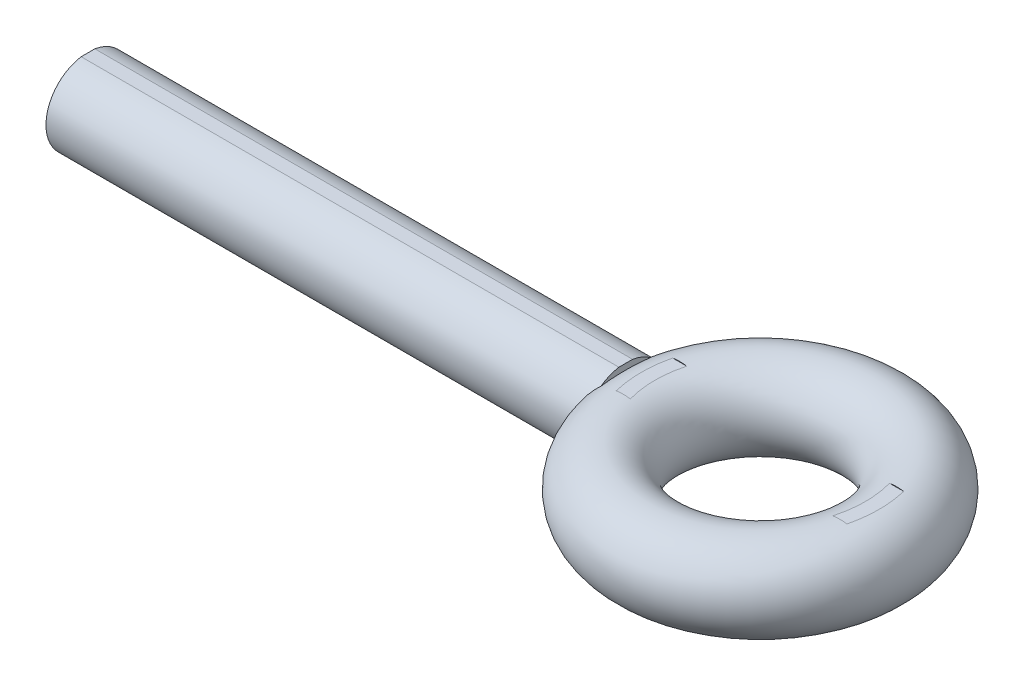
ISO-10303-21;
HEADER;
FILE_DESCRIPTION(('STEP AP214'),'2;1');
FILE_NAME('part.step','',(''),(''),'','','');
FILE_SCHEMA(('AUTOMOTIVE_DESIGN { 1 0 10303 214 1 1 1 1 }'));
ENDSEC;
DATA;
#1=APPLICATION_CONTEXT('core data for automotive mechanical design processes');
#2=APPLICATION_PROTOCOL_DEFINITION('international standard','automotive_design',2000,#1);
#3=PRODUCT_CONTEXT('',#1,'mechanical');
#4=PRODUCT('Part','Part','',(#3));
#5=PRODUCT_RELATED_PRODUCT_CATEGORY('part','',(#4));
#6=PRODUCT_DEFINITION_FORMATION('','',#4);
#7=PRODUCT_DEFINITION_CONTEXT('part definition',#1,'design');
#8=PRODUCT_DEFINITION('design','',#6,#7);
#9=PRODUCT_DEFINITION_SHAPE('','',#8);
#10=(LENGTH_UNIT() NAMED_UNIT(*) SI_UNIT(.MILLI.,.METRE.));
#11=(NAMED_UNIT(*) PLANE_ANGLE_UNIT() SI_UNIT($,.RADIAN.));
#12=(NAMED_UNIT(*) SI_UNIT($,.STERADIAN.) SOLID_ANGLE_UNIT());
#13=UNCERTAINTY_MEASURE_WITH_UNIT(LENGTH_MEASURE(1.E-05),#10,'distance_accuracy_value','');
#14=(GEOMETRIC_REPRESENTATION_CONTEXT(3) GLOBAL_UNCERTAINTY_ASSIGNED_CONTEXT((#13)) GLOBAL_UNIT_ASSIGNED_CONTEXT((#10,
#11,#12)) REPRESENTATION_CONTEXT('',''));
#15=CARTESIAN_POINT('',(0.,0.,0.));
#16=DIRECTION('',(0.,0.,1.));
#17=DIRECTION('',(1.,0.,0.));
#18=AXIS2_PLACEMENT_3D('',#15,#16,#17);
#19=CARTESIAN_POINT('',(93.6625,4.699,-3.17814504581193));
#20=DIRECTION('',(0.,1.,0.));
#21=DIRECTION('',(0.,0.,1.));
#22=AXIS2_PLACEMENT_3D('',#19,#20,#21);
#23=PLANE('',#22);
#24=DIRECTION('',(-1.,0.,0.));
#25=VECTOR('',#24,1.);
#26=CARTESIAN_POINT('',(60.96,4.699,-0.775116281599091));
#27=LINE('',#26,#25);
#28=CARTESIAN_POINT('',(0.,4.699,-0.775116281599091));
#29=VERTEX_POINT('',#28);
#30=CARTESIAN_POINT('',(60.96,4.699,-0.775116281599091));
#31=VERTEX_POINT('',#30);
#32=EDGE_CURVE('E119',#29,#31,#27,.F.);
#33=ORIENTED_EDGE('',*,*,#32,.F.);
#34=DIRECTION('',(0.,0.,-1.));
#35=VECTOR('',#34,1.);
#36=CARTESIAN_POINT('',(0.,4.699,-0.775116281599091));
#37=LINE('',#36,#35);
#38=CARTESIAN_POINT('',(0.,4.699,0.775116281599092));
#39=VERTEX_POINT('',#38);
#40=EDGE_CURVE('E120',#39,#29,#37,.T.);
#41=ORIENTED_EDGE('',*,*,#40,.F.);
#42=DIRECTION('',(-1.,0.,0.));
#43=VECTOR('',#42,1.);
#44=CARTESIAN_POINT('',(60.96,4.699,0.775116281599092));
#45=LINE('',#44,#43);
#46=CARTESIAN_POINT('',(60.96,4.699,0.775116281599092));
#47=VERTEX_POINT('',#46);
#48=EDGE_CURVE('E175',#47,#39,#45,.T.);
#49=ORIENTED_EDGE('',*,*,#48,.F.);
#50=DIRECTION('',(0.,0.,-1.));
#51=VECTOR('',#50,1.);
#52=CARTESIAN_POINT('',(60.96,4.699,0.));
#53=LINE('',#52,#51);
#54=EDGE_CURVE('E176',#31,#47,#53,.F.);
#55=ORIENTED_EDGE('',*,*,#54,.F.);
#56=EDGE_LOOP('',(#33,#41,#49,#55));
#57=FACE_BOUND('',#56,.T.);
#58=ADVANCED_FACE('F40',(#57),#23,.T.);
#59=CARTESIAN_POINT('',(60.96,0.,0.));
#60=DIRECTION('',(1.,0.,0.));
#61=DIRECTION('',(0.,0.,-1.));
#62=AXIS2_PLACEMENT_3D('',#59,#60,#61);
#63=PLANE('',#62);
#64=CARTESIAN_POINT('',(60.96,-3.85680829831834,2.79400000002241));
#65=CARTESIAN_POINT('',(60.96,-3.88106554887793,2.60811533049679));
#66=CARTESIAN_POINT('',(60.96,-3.90241108362914,2.42186657422565));
#67=CARTESIAN_POINT('',(60.96,-3.93969565290047,2.04931800768592));
#68=CARTESIAN_POINT('',(60.96,-3.95564867072227,1.86301960284457));
#69=CARTESIAN_POINT('',(60.96,-3.98266267944582,1.49041115000553));
#70=CARTESIAN_POINT('',(60.96,-3.99373242918019,1.30410172726012));
#71=CARTESIAN_POINT('',(60.96,-4.01130742422769,0.931486209871611));
#72=CARTESIAN_POINT('',(60.96,-4.01781796126506,0.745180363181703));
#73=CARTESIAN_POINT('',(60.96,-4.02647459383097,0.372582969947983));
#74=CARTESIAN_POINT('',(60.96,-4.02862336909261,0.186291484979667));
#75=CARTESIAN_POINT('',(60.96,-4.02862336909279,-0.186291484956967));
#76=CARTESIAN_POINT('',(60.96,-4.02647459383132,-0.372582969925284));
#77=CARTESIAN_POINT('',(60.96,-4.01781796126576,-0.745180363159011));
#78=CARTESIAN_POINT('',(60.96,-4.01130742422858,-0.931486209848925));
#79=CARTESIAN_POINT('',(60.96,-3.99373242918144,-1.30410172723745));
#80=CARTESIAN_POINT('',(60.96,-3.98266267944726,-1.49041114998287));
#81=CARTESIAN_POINT('',(60.96,-3.95564867072411,-1.86301960282194));
#82=CARTESIAN_POINT('',(60.96,-3.93969565290251,-2.04931800766331));
#83=CARTESIAN_POINT('',(60.96,-3.90241108363162,-2.42186657420308));
#84=CARTESIAN_POINT('',(60.96,-3.88106554888064,-2.60811533047424));
#85=CARTESIAN_POINT('',(60.96,-3.85680829832128,-2.79399999999989));
#86=B_SPLINE_CURVE_WITH_KNOTS('',3,(#64,#65,#66,#67,#68,#69,#70,#71,#72,#73,#74,#75,#76,#77,#78,
#79,#80,#81,#82,#83,#84,#85),.UNSPECIFIED.,.F.,.F.,(4,2,2,2,2,2,2,2,2,2,4),(0.,
0.562336181640379,1.12320278141193,1.68305925610424,2.24226484243817,2.8011267658447,
3.35998868925122,3.91919427558516,4.47905075027746,5.03991735004901,5.60225353168939),.UNSPECIFIED.);
#87=CARTESIAN_POINT('',(60.96,-3.85680829831228,2.79400000002161));
#88=VERTEX_POINT('',#87);
#89=CARTESIAN_POINT('',(60.96,-3.85680829832135,-2.79399999999992));
#90=VERTEX_POINT('',#89);
#91=EDGE_CURVE('E109',#88,#90,#86,.T.);
#92=ORIENTED_EDGE('',*,*,#91,.F.);
#93=CARTESIAN_POINT('',(60.96,0.,0.));
#94=DIRECTION('',(-1.,0.,0.));
#95=DIRECTION('',(0.,0.,1.));
#96=AXIS2_PLACEMENT_3D('',#93,#94,#95);
#97=CIRCLE('',#96,4.7625);
#98=EDGE_CURVE('E43',#90,#88,#97,.T.);
#99=ORIENTED_EDGE('',*,*,#98,.F.);
#100=EDGE_LOOP('',(#92,#99));
#101=FACE_BOUND('',#100,.T.);
#102=ADVANCED_FACE('F121',(#101),#63,.T.);
#103=CARTESIAN_POINT('',(60.96,0.,0.));
#104=DIRECTION('',(1.,0.,0.));
#105=DIRECTION('',(0.,0.,-1.));
#106=AXIS2_PLACEMENT_3D('',#103,#104,#105);
#107=PLANE('',#106);
#108=CARTESIAN_POINT('',(60.96,0.,0.));
#109=DIRECTION('',(-1.,0.,0.));
#110=DIRECTION('',(0.,0.,1.));
#111=AXIS2_PLACEMENT_3D('',#108,#109,#110);
#112=CIRCLE('',#111,4.7625);
#113=CARTESIAN_POINT('',(60.9599999999962,3.85680829831314,2.79400000001125));
#114=VERTEX_POINT('',#113);
#115=EDGE_CURVE('E141',#114,#47,#112,.T.);
#116=ORIENTED_EDGE('',*,*,#115,.F.);
#117=CARTESIAN_POINT('',(60.96,3.85680829831818,-2.79400000002366));
#118=CARTESIAN_POINT('',(60.96,3.88106554887787,-2.60811533049741));
#119=CARTESIAN_POINT('',(60.96,3.90241108362915,-2.42186657422565));
#120=CARTESIAN_POINT('',(60.96,3.93969565290058,-2.04931800768467));
#121=CARTESIAN_POINT('',(60.96,3.95564867072242,-1.8630196028427));
#122=CARTESIAN_POINT('',(60.96,3.98266267944602,-1.49041115000241));
#123=CARTESIAN_POINT('',(60.96,3.9937324291804,-1.30410172725638));
#124=CARTESIAN_POINT('',(60.96,4.01130742422789,-0.931486209866634));
#125=CARTESIAN_POINT('',(60.96,4.01781796126524,-0.745180363176106));
#126=CARTESIAN_POINT('',(60.96,4.02647459383108,-0.37258296994115));
#127=CARTESIAN_POINT('',(60.96,4.02862336909267,-0.186291484972216));
#128=CARTESIAN_POINT('',(60.96,4.02862336909272,0.186291484965653));
#129=CARTESIAN_POINT('',(60.96,4.02647459383118,0.372582969934587));
#130=CARTESIAN_POINT('',(60.96,4.01781796126544,0.745180363169546));
#131=CARTESIAN_POINT('',(60.96,4.01130742422815,0.931486209860076));
#132=CARTESIAN_POINT('',(60.96,3.99373242918076,1.30410172724983));
#133=CARTESIAN_POINT('',(60.96,3.98266267944644,1.49041114999586));
#134=CARTESIAN_POINT('',(60.96,3.95564867072295,1.86301960283616));
#135=CARTESIAN_POINT('',(60.96,3.93969565290118,2.04931800767813));
#136=CARTESIAN_POINT('',(60.96,3.90241108362987,2.42186657421913));
#137=CARTESIAN_POINT('',(60.96,3.88106554887865,2.60811533049089));
#138=CARTESIAN_POINT('',(60.96,3.85680829831903,2.79400000001715));
#139=B_SPLINE_CURVE_WITH_KNOTS('',3,(#117,#118,#119,#120,#121,#122,#123,#124,#125,#126,#127,
#128,#129,#130,#131,#132,#133,#134,#135,#136,#137,#138),.UNSPECIFIED.,.F.,.F.,(4,2,2,2,2,2,2,2,
2,2,4),(0.,0.562336181642267,1.12320278141569,1.68305925610986,2.24226484244565,
2.80112676585402,3.3599886892624,3.91919427559819,4.47905075029236,5.03991735006578,
5.60225353170805),.UNSPECIFIED.);
#140=CARTESIAN_POINT('',(60.96,3.85680829831177,-2.79400000002282));
#141=VERTEX_POINT('',#140);
#142=EDGE_CURVE('E111',#141,#114,#139,.T.);
#143=ORIENTED_EDGE('',*,*,#142,.F.);
#144=CARTESIAN_POINT('',(60.96,0.,0.));
#145=DIRECTION('',(-1.,0.,0.));
#146=DIRECTION('',(0.,0.,1.));
#147=AXIS2_PLACEMENT_3D('',#144,#145,#146);
#148=CIRCLE('',#147,4.7625);
#149=EDGE_CURVE('E178',#141,#31,#148,.F.);
#150=ORIENTED_EDGE('',*,*,#149,.T.);
#151=ORIENTED_EDGE('',*,*,#54,.T.);
#152=EDGE_LOOP('',(#116,#143,#150,#151));
#153=FACE_BOUND('',#152,.T.);
#154=ADVANCED_FACE('F253',(#153),#107,.T.);
#155=CARTESIAN_POINT('',(60.96,0.,0.));
#156=DIRECTION('',(-1.,0.,0.));
#157=DIRECTION('',(0.,0.,1.));
#158=AXIS2_PLACEMENT_3D('',#155,#156,#157);
#159=CYLINDRICAL_SURFACE('',#158,4.7625);
#160=ORIENTED_EDGE('',*,*,#149,.F.);
#161=CARTESIAN_POINT('',(60.9600000000001,-3.85680829832134,-2.79399999999994));
#162=CARTESIAN_POINT('',(60.8785504523994,-3.7860101988597,-2.89173469472768));
#163=CARTESIAN_POINT('',(60.7990695374057,-3.71067503111005,-2.98790012670303));
#164=CARTESIAN_POINT('',(60.6445111305986,-3.55077235846282,-3.17627109256745));
#165=CARTESIAN_POINT('',(60.5694391562109,-3.46619364920776,-3.26847162765873));
#166=CARTESIAN_POINT('',(60.4239376012221,-3.28729069450069,-3.44837843563018));
#167=CARTESIAN_POINT('',(60.3535381517923,-3.19291169246871,-3.53605485381351));
#168=CARTESIAN_POINT('',(60.2185487215298,-2.99496076167127,-3.70520605164519));
#169=CARTESIAN_POINT('',(60.153955862238,-2.89139343892524,-3.78668390095148));
#170=CARTESIAN_POINT('',(60.0410643418266,-2.69259866790364,-3.9298638988467));
#171=CARTESIAN_POINT('',(59.9918121401095,-2.59868790190733,-3.99264439293863));
#172=CARTESIAN_POINT('',(59.8983082570006,-2.40482600948102,-4.11232158725517));
#173=CARTESIAN_POINT('',(59.8540557747586,-2.30487585438243,-4.16921922966512));
#174=CARTESIAN_POINT('',(59.7710684374688,-2.09953043245678,-4.27630208728406));
#175=CARTESIAN_POINT('',(59.7323226595295,-1.99414652642704,-4.32650057825406));
#176=CARTESIAN_POINT('',(59.6606774378077,-1.77829350779267,-4.41960262201934));
#177=CARTESIAN_POINT('',(59.6277771240797,-1.66782515496204,-4.46250726027399));
#178=CARTESIAN_POINT('',(59.5713911744848,-1.45447182014165,-4.53621745699394));
#179=CARTESIAN_POINT('',(59.5472764646304,-1.35202935920477,-4.56782440875256));
#180=CARTESIAN_POINT('',(59.5042945939236,-1.14422234932699,-4.62425655307724));
#181=CARTESIAN_POINT('',(59.485426709522,-1.03885820549886,-4.64908268072604));
#182=CARTESIAN_POINT('',(59.4531800081042,-0.826067705733072,-4.69156378379552));
#183=CARTESIAN_POINT('',(59.4397915106254,-0.718645340753197,-4.70923140563128));
#184=CARTESIAN_POINT('',(59.4186217060468,-0.502341322280044,-4.73718678222424));
#185=CARTESIAN_POINT('',(59.4108371622417,-0.393460548206505,-4.74747879693439));
#186=CARTESIAN_POINT('',(59.4037602022141,-0.236966014565057,-4.75683732497496));
#187=CARTESIAN_POINT('',(59.4021553757281,-0.18961427871017,-4.75895995347434));
#188=CARTESIAN_POINT('',(59.4000147126558,-0.0948438224345969,-4.76179151837386));
#189=CARTESIAN_POINT('',(59.3994788949018,-0.0474251008485867,-4.76250042986934));
#190=CARTESIAN_POINT('',(59.399479843835,0.113393800140544,-4.76249897217895));
#191=CARTESIAN_POINT('',(59.4025453398251,0.226824070065428,-4.75844269672319));
#192=CARTESIAN_POINT('',(59.4147713822717,0.452829871615858,-4.74227809349639));
#193=CARTESIAN_POINT('',(59.4239358211327,0.565404810925087,-4.73016462354828));
#194=CARTESIAN_POINT('',(59.4482662213249,0.789002410434107,-4.69804868121557));
#195=CARTESIAN_POINT('',(59.4634442500447,0.900021481833622,-4.67803034651804));
#196=CARTESIAN_POINT('',(59.4996143750039,1.1194985374963,-4.63041549029862));
#197=CARTESIAN_POINT('',(59.5206089519626,1.22795540753036,-4.60281573539386));
#198=CARTESIAN_POINT('',(59.5680351625792,1.44098556791716,-4.54061794381888));
#199=CARTESIAN_POINT('',(59.5944380753438,1.54557606193287,-4.50605689057745));
#200=CARTESIAN_POINT('',(59.652452220066,1.75086653181407,-4.43033450871213));
#201=CARTESIAN_POINT('',(59.6840654798536,1.85156497400867,-4.38917061047536));
#202=CARTESIAN_POINT('',(59.7862012831295,2.14686471254733,-4.25662019578979));
#203=CARTESIAN_POINT('',(59.864081828659,2.33494464971961,-4.15609312810247));
#204=CARTESIAN_POINT('',(60.0420311652813,2.70158686258682,-3.92840815784323));
#205=CARTESIAN_POINT('',(60.1431857512938,2.87881094953318,-3.79997484165973));
#206=CARTESIAN_POINT('',(60.3613693660764,3.20853260520096,-3.52599768340604));
#207=CARTESIAN_POINT('',(60.4784026145598,3.36102357743167,-3.38044929442504));
#208=CARTESIAN_POINT('',(60.6590215499961,3.5656304910323,-3.15861142149541));
#209=CARTESIAN_POINT('',(60.7175533205018,3.62766845363822,-3.08710937714316));
#210=CARTESIAN_POINT('',(60.8370059042828,3.7462640988818,-2.94204842975802));
#211=CARTESIAN_POINT('',(60.8979198358935,3.80283613467735,-2.86849560560491));
#212=CARTESIAN_POINT('',(60.9599999999874,3.85680829831034,-2.79400000001512));
#213=B_SPLINE_CURVE_WITH_KNOTS('',3,(#161,#162,#163,#164,#165,#166,#167,#168,#169,#170,#171,
#172,#173,#174,#175,#176,#177,#178,#179,#180,#181,#182,#183,#184,#185,#186,#187,#188,#189,#190,
#191,#192,#193,#194,#195,#196,#197,#198,#199,#200,#201,#202,#203,#204,#205,#206,#207,#208,#209,
#210,#211,#212),.UNSPECIFIED.,.F.,.F.,(4,2,2,2,2,2,2,2,2,2,2,2,2,2,2,2,2,2,2,2,2,2,2,2,2,4),(0.,
0.436776236091201,0.874087899341334,1.31398980725578,1.75367242918317,2.12301046354662,
2.49228925356734,2.86082501551345,3.22930588446079,3.55860854371662,3.88786576883759,
4.21653875587007,4.54502175686349,4.68727364610974,4.82952804130651,5.16965945197457,
5.51000814625,5.85104330109867,6.19222412969371,6.53163802747237,6.87118433602823,
7.54940865378636,8.27019930732146,8.99118188565513,9.32493200027034,9.65778042791278),.UNSPECIFIED.);
#214=EDGE_CURVE('E99',#90,#141,#213,.T.);
#215=ORIENTED_EDGE('',*,*,#214,.F.);
#216=ORIENTED_EDGE('',*,*,#98,.T.);
#217=CARTESIAN_POINT('',(60.9599999999924,3.85680829831465,2.79400000000916));
#218=CARTESIAN_POINT('',(60.8785504523919,3.78601019885286,2.89173469473663));
#219=CARTESIAN_POINT('',(60.7990695373985,3.71067503110306,2.9879001267117));
#220=CARTESIAN_POINT('',(60.644511130592,3.55077235845558,3.17627109257554));
#221=CARTESIAN_POINT('',(60.5694391562045,3.4661936492004,3.26847162766653));
#222=CARTESIAN_POINT('',(60.4239376012163,3.28729069449315,3.44837843563737));
#223=CARTESIAN_POINT('',(60.3535381517868,3.19291169246109,3.53605485382039));
#224=CARTESIAN_POINT('',(60.2185487215248,2.99496076166354,3.70520605165144));
#225=CARTESIAN_POINT('',(60.1539558622333,2.89139343891745,3.7866839009574));
#226=CARTESIAN_POINT('',(60.0410643418224,2.69259866789574,3.92986389885209));
#227=CARTESIAN_POINT('',(59.9918121401054,2.59868790189936,3.99264439294381));
#228=CARTESIAN_POINT('',(59.8983082569969,2.40482600947291,4.11232158725991));
#229=CARTESIAN_POINT('',(59.8540557747551,2.30487585437427,4.16921922966964));
#230=CARTESIAN_POINT('',(59.7710684374657,2.09953043244852,4.27630208728811));
#231=CARTESIAN_POINT('',(59.7323226595265,1.99414652641874,4.32650057825788));
#232=CARTESIAN_POINT('',(59.6606774378051,1.77829350778432,4.4196026220227));
#233=CARTESIAN_POINT('',(59.6277771240773,1.66782515495368,4.46250726027712));
#234=CARTESIAN_POINT('',(59.5713911744827,1.45447182013319,4.53621745699665));
#235=CARTESIAN_POINT('',(59.5472764646285,1.35202935919623,4.56782440875508));
#236=CARTESIAN_POINT('',(59.504294593922,1.14422234931831,4.62425655307939));
#237=CARTESIAN_POINT('',(59.4854267095205,1.03885820549012,4.649082680728));
#238=CARTESIAN_POINT('',(59.4531800081031,0.826067705724223,4.69156378379708));
#239=CARTESIAN_POINT('',(59.4397915106244,0.718645340744307,4.70923140563263));
#240=CARTESIAN_POINT('',(59.4186217060461,0.502341322271099,4.73718678222519));
#241=CARTESIAN_POINT('',(59.4108371622412,0.393460548197545,4.74747879693516));
#242=CARTESIAN_POINT('',(59.4037602022139,0.236966014559423,4.75683732497522));
#243=CARTESIAN_POINT('',(59.402155375728,0.189614278707876,4.7589599534744));
#244=CARTESIAN_POINT('',(59.4000147126559,0.0948438224389941,4.76179151837373));
#245=CARTESIAN_POINT('',(59.3994788949019,0.0474251008563339,4.76250042986922));
#246=CARTESIAN_POINT('',(59.3994798438348,-0.11339380012936,4.76249897217921));
#247=CARTESIAN_POINT('',(59.4025453398247,-0.226824070054171,4.75844269672372));
#248=CARTESIAN_POINT('',(59.4147713822709,-0.452829871604488,4.74227809349748));
#249=CARTESIAN_POINT('',(59.4239358211316,-0.565404810913676,4.73016462354965));
#250=CARTESIAN_POINT('',(59.4482662213234,-0.789002410422648,4.69804868121749));
#251=CARTESIAN_POINT('',(59.4634442500431,-0.900021481822155,4.67803034652024));
#252=CARTESIAN_POINT('',(59.4996143750018,-1.11949853748485,4.63041549030139));
#253=CARTESIAN_POINT('',(59.5206089519603,-1.22795540751894,4.60281573539691));
#254=CARTESIAN_POINT('',(59.5680351625765,-1.44098556790582,4.54061794382249));
#255=CARTESIAN_POINT('',(59.5944380753409,-1.54557606192158,4.50605689058132));
#256=CARTESIAN_POINT('',(59.6524522200626,-1.75086653180292,4.43033450871653));
#257=CARTESIAN_POINT('',(59.68406547985,-1.8515649739976,4.38917061048002));
#258=CARTESIAN_POINT('',(59.7862012831253,-2.14686471253654,4.25662019579524));
#259=CARTESIAN_POINT('',(59.8640818286543,-2.33494464970905,4.15609312810842));
#260=CARTESIAN_POINT('',(60.0420311652758,-2.7015868625767,3.9284081578502));
#261=CARTESIAN_POINT('',(60.1431857512878,-2.87881094952327,3.79997484166724));
#262=CARTESIAN_POINT('',(60.3613693660696,-3.20853260519158,3.52599768341457));
#263=CARTESIAN_POINT('',(60.4784026145526,-3.3610235774226,3.38044929443407));
#264=CARTESIAN_POINT('',(60.6590215499896,-3.56563049102538,3.1586114215033));
#265=CARTESIAN_POINT('',(60.7175533204967,-3.62766845363299,3.08710937714939));
#266=CARTESIAN_POINT('',(60.8370059042805,-3.74626409887966,2.94204842976081));
#267=CARTESIAN_POINT('',(60.8979198358926,-3.80283613467664,2.86849560560592));
#268=CARTESIAN_POINT('',(60.9599999999881,-3.85680829831092,2.79400000001432));
#269=B_SPLINE_CURVE_WITH_KNOTS('',3,(#217,#218,#219,#220,#221,#222,#223,#224,#225,#226,#227,
#228,#229,#230,#231,#232,#233,#234,#235,#236,#237,#238,#239,#240,#241,#242,#243,#244,#245,#246,
#247,#248,#249,#250,#251,#252,#253,#254,#255,#256,#257,#258,#259,#260,#261,#262,#263,#264,#265,
#266,#267,#268),.UNSPECIFIED.,.F.,.F.,(4,2,2,2,2,2,2,2,2,2,2,2,2,2,2,2,2,2,2,2,2,2,2,2,2,4),(0.,
0.436776236090421,0.874087899339775,1.31398980725342,1.75367242918,2.12301046354308,
2.49228925356344,2.86082501550918,3.22930588445617,3.55860854371197,3.88786576883291,
4.21653875586536,4.54502175685873,4.68727364609494,4.82952804128167,5.16965945194947,
5.51000814622464,5.85104330107305,6.19222412966784,6.53163802744626,6.87118433600187,
7.54940865375951,8.27019930729364,8.99118188562637,9.32493200024971,9.65778042790022),.UNSPECIFIED.);
#270=EDGE_CURVE('E106',#114,#88,#269,.T.);
#271=ORIENTED_EDGE('',*,*,#270,.F.);
#272=ORIENTED_EDGE('',*,*,#115,.T.);
#273=ORIENTED_EDGE('',*,*,#48,.T.);
#274=CARTESIAN_POINT('',(0.,0.,0.));
#275=DIRECTION('',(-1.,0.,0.));
#276=DIRECTION('',(0.,0.,-1.));
#277=AXIS2_PLACEMENT_3D('',#274,#275,#276);
#278=CIRCLE('',#277,4.7625);
#279=EDGE_CURVE('E276',#29,#39,#278,.T.);
#280=ORIENTED_EDGE('',*,*,#279,.F.);
#281=ORIENTED_EDGE('',*,*,#32,.T.);
#282=EDGE_LOOP('',(#160,#215,#216,#271,#272,#273,#280,#281));
#283=FACE_BOUND('',#282,.T.);
#284=ADVANCED_FACE('F116',(#283),#159,.T.);
#285=CARTESIAN_POINT('',(93.6625,8.0391582902215,3.2400094700158));
#286=DIRECTION('',(0.,0.,-1.));
#287=DIRECTION('',(0.,1.,0.));
#288=AXIS2_PLACEMENT_3D('',#285,#286,#287);
#289=PLANE('',#288);
#290=DIRECTION('',(1.,0.,0.));
#291=VECTOR('',#290,1.);
#292=CARTESIAN_POINT('',(93.6625,4.699,3.2400094700158));
#293=LINE('',#292,#291);
#294=CARTESIAN_POINT('',(63.1202026989398,4.699,3.2400094700158));
#295=VERTEX_POINT('',#294);
#296=CARTESIAN_POINT('',(64.7237118225624,4.699,3.24000947001579));
#297=VERTEX_POINT('',#296);
#298=EDGE_CURVE('E169',#295,#297,#293,.T.);
#299=ORIENTED_EDGE('',*,*,#298,.F.);
#300=CARTESIAN_POINT('',(64.7237118225624,4.699,3.24000947001579));
#301=CARTESIAN_POINT('',(64.657090125659,4.70957671098115,3.24000947001579));
#302=CARTESIAN_POINT('',(64.5902603298811,4.71884405407927,3.2400094700158));
#303=CARTESIAN_POINT('',(64.4565982642088,4.73470469833683,3.2400094700158));
#304=CARTESIAN_POINT('',(64.3897674405789,4.74131019074887,3.2400094700158));
#305=CARTESIAN_POINT('',(64.2561056307831,4.75187369702555,3.2400094700158));
#306=CARTESIAN_POINT('',(64.1892752897878,4.755839869813,3.2400094700158));
#307=CARTESIAN_POINT('',(64.0556157765206,4.76113958808852,3.2400094700158));
#308=CARTESIAN_POINT('',(63.9887867685872,4.76247727510699,3.2400094700158));
#309=CARTESIAN_POINT('',(63.8551252547764,4.76252215151022,3.2400094700158));
#310=CARTESIAN_POINT('',(63.7882927488616,4.7612292425631,3.2400094700158));
#311=CARTESIAN_POINT('',(63.6546272698688,4.75600221320093,3.2400094700158));
#312=CARTESIAN_POINT('',(63.5877944565288,4.75206400332793,3.2400094700158));
#313=CARTESIAN_POINT('',(63.4541299358875,4.74152294019658,3.2400094700158));
#314=CARTESIAN_POINT('',(63.3872988785957,4.73491183699959,3.2400094700158));
#315=CARTESIAN_POINT('',(63.2536402903402,4.71898974886777,3.2400094700158));
#316=CARTESIAN_POINT('',(63.1868142552251,4.70966620810456,3.2400094700158));
#317=CARTESIAN_POINT('',(63.1202026989398,4.699,3.24000947001579));
#318=B_SPLINE_CURVE_WITH_KNOTS('',3,(#300,#301,#302,#303,#304,#305,#306,#307,#308,#309,#310,
#311,#312,#313,#314,#315,#316,#317),.UNSPECIFIED.,.F.,.F.,(4,2,2,2,2,2,2,2,4),(0.,
0.202355423495322,0.403773229785628,0.604565464889204,0.805041070507354,1.00552417005826,
1.20631791855181,1.40773621078039,1.61010211765383),.UNSPECIFIED.);
#319=EDGE_CURVE('E114',#297,#295,#318,.T.);
#320=ORIENTED_EDGE('',*,*,#319,.F.);
#321=EDGE_LOOP('',(#299,#320));
#322=FACE_BOUND('',#321,.T.);
#323=ADVANCED_FACE('F234',(#322),#289,.T.);
#324=CARTESIAN_POINT('',(93.6625,8.0391582902215,-3.17814504581193));
#325=DIRECTION('',(0.,0.,1.));
#326=DIRECTION('',(0.,-1.,0.));
#327=AXIS2_PLACEMENT_3D('',#324,#325,#326);
#328=PLANE('',#327);
#329=DIRECTION('',(1.,0.,0.));
#330=VECTOR('',#329,1.);
#331=CARTESIAN_POINT('',(93.6625,4.699,-3.17814504581193));
#332=LINE('',#331,#330);
#333=CARTESIAN_POINT('',(64.7064258924751,4.699,-3.17814504581193));
#334=VERTEX_POINT('',#333);
#335=CARTESIAN_POINT('',(63.1050333001418,4.699,-3.17814504581193));
#336=VERTEX_POINT('',#335);
#337=EDGE_CURVE('E174',#334,#336,#332,.F.);
#338=ORIENTED_EDGE('',*,*,#337,.F.);
#339=CARTESIAN_POINT('',(63.1050333001418,4.699,-3.17814504581193));
#340=CARTESIAN_POINT('',(63.1715566040445,4.70966443321718,-3.17814504581193));
#341=CARTESIAN_POINT('',(63.2382945390264,4.71898690505478,-3.17814504581193));
#342=CARTESIAN_POINT('',(63.3717768621496,4.73490778687418,-3.17814504581193));
#343=CARTESIAN_POINT('',(63.4385197495785,4.74151877795291,-3.17814504581193));
#344=CARTESIAN_POINT('',(63.5720078920676,4.75206025393222,-3.17814504581193));
#345=CARTESIAN_POINT('',(63.6387524946549,4.75599900851943,-3.17814504581193));
#346=CARTESIAN_POINT('',(63.7722415307,4.7612274649909,-3.17814504581193));
#347=CARTESIAN_POINT('',(63.8389858036959,4.76252126816262,-3.17814504581193));
#348=CARTESIAN_POINT('',(63.9724709884979,4.76247820382174,-3.17814504581193));
#349=CARTESIAN_POINT('',(64.0392119003386,4.76114143091883,-3.17814504581193));
#350=CARTESIAN_POINT('',(64.1726952040524,4.75584322173649,-3.17814504581193));
#351=CARTESIAN_POINT('',(64.2394374310315,4.75187763406962,-3.17814504581193));
#352=CARTESIAN_POINT('',(64.3729229688406,4.74131462260177,-3.17814504581193));
#353=CARTESIAN_POINT('',(64.4396656318599,4.73470901668535,-3.17814504581193));
#354=CARTESIAN_POINT('',(64.5731512963551,4.71884709720147,-3.17814504581193));
#355=CARTESIAN_POINT('',(64.6398928448858,4.70957855328852,-3.17814504581193));
#356=CARTESIAN_POINT('',(64.7064258924751,4.699,-3.17814504581193));
#357=B_SPLINE_CURVE_WITH_KNOTS('',3,(#339,#340,#341,#342,#343,#344,#345,#346,#347,#348,#349,
#350,#351,#352,#353,#354,#355,#356),.UNSPECIFIED.,.F.,.F.,(4,2,2,2,2,2,2,2,4),(0.,
0.202103660498894,0.403258664923948,0.603788286521,0.804006728355524,1.00421796938607,
1.20474613679701,1.40590067428655,1.60799426174385),.UNSPECIFIED.);
#358=EDGE_CURVE('E220',#336,#334,#357,.T.);
#359=ORIENTED_EDGE('',*,*,#358,.F.);
#360=EDGE_LOOP('',(#338,#359));
#361=FACE_BOUND('',#360,.T.);
#362=ADVANCED_FACE('F230',(#361),#328,.T.);
#363=CARTESIAN_POINT('',(93.6625,4.699,-3.17814504581193));
#364=DIRECTION('',(0.,1.,0.));
#365=DIRECTION('',(0.,0.,1.));
#366=AXIS2_PLACEMENT_3D('',#363,#364,#365);
#367=PLANE('',#366);
#368=ORIENTED_EDGE('',*,*,#337,.T.);
#369=CARTESIAN_POINT('',(76.2,4.699,0.));
#370=DIRECTION('',(0.,1.,0.));
#371=DIRECTION('',(0.,0.,1.));
#372=AXIS2_PLACEMENT_3D('',#369,#370,#371);
#373=CIRCLE('',#372,13.475116281599);
#374=EDGE_CURVE('E228',#295,#336,#373,.F.);
#375=ORIENTED_EDGE('',*,*,#374,.F.);
#376=ORIENTED_EDGE('',*,*,#298,.T.);
#377=CARTESIAN_POINT('',(76.2,4.699,0.));
#378=DIRECTION('',(0.,1.,0.));
#379=DIRECTION('',(0.,0.,1.));
#380=AXIS2_PLACEMENT_3D('',#377,#378,#379);
#381=CIRCLE('',#380,11.924883718401);
#382=EDGE_CURVE('E217',#334,#297,#381,.T.);
#383=ORIENTED_EDGE('',*,*,#382,.F.);
#384=EDGE_LOOP('',(#368,#375,#376,#383));
#385=FACE_BOUND('',#384,.T.);
#386=ADVANCED_FACE('F207',(#385),#367,.T.);
#387=CARTESIAN_POINT('',(93.6625,8.0391582902215,-3.17814504581193));
#388=DIRECTION('',(0.,0.,1.));
#389=DIRECTION('',(0.,-1.,0.));
#390=AXIS2_PLACEMENT_3D('',#387,#388,#389);
#391=PLANE('',#390);
#392=DIRECTION('',(1.,0.,0.));
#393=VECTOR('',#392,1.);
#394=CARTESIAN_POINT('',(93.6625,4.699,-3.17814504581193));
#395=LINE('',#394,#393);
#396=CARTESIAN_POINT('',(89.2949666998582,4.699,-3.17814504581193));
#397=VERTEX_POINT('',#396);
#398=CARTESIAN_POINT('',(87.6935741075249,4.699,-3.17814504581193));
#399=VERTEX_POINT('',#398);
#400=EDGE_CURVE('E128',#397,#399,#395,.F.);
#401=ORIENTED_EDGE('',*,*,#400,.F.);
#402=CARTESIAN_POINT('',(87.6935741075249,4.699,-3.17814504581193));
#403=CARTESIAN_POINT('',(87.7601071551142,4.70957855328852,-3.17814504581193));
#404=CARTESIAN_POINT('',(87.8268487036449,4.71884709720147,-3.17814504581193));
#405=CARTESIAN_POINT('',(87.9603343681402,4.73470901668535,-3.17814504581193));
#406=CARTESIAN_POINT('',(88.0270770311594,4.74131462260177,-3.17814504581193));
#407=CARTESIAN_POINT('',(88.1605625689685,4.75187763406962,-3.17814504581193));
#408=CARTESIAN_POINT('',(88.2273047959476,4.75584322173649,-3.17814504581193));
#409=CARTESIAN_POINT('',(88.3607880996614,4.76114143091883,-3.17814504581193));
#410=CARTESIAN_POINT('',(88.4275290115021,4.76247820382174,-3.17814504581193));
#411=CARTESIAN_POINT('',(88.5610141963041,4.76252126816262,-3.17814504581193));
#412=CARTESIAN_POINT('',(88.6277584693,4.7612274649909,-3.17814504581193));
#413=CARTESIAN_POINT('',(88.7612475053451,4.75599900851943,-3.17814504581193));
#414=CARTESIAN_POINT('',(88.8279921079324,4.75206025393222,-3.17814504581193));
#415=CARTESIAN_POINT('',(88.9614802504215,4.74151877795291,-3.17814504581193));
#416=CARTESIAN_POINT('',(89.0282231378504,4.73490778687418,-3.17814504581193));
#417=CARTESIAN_POINT('',(89.1617054609736,4.71898690505478,-3.17814504581193));
#418=CARTESIAN_POINT('',(89.2284433959555,4.70966443321718,-3.17814504581193));
#419=CARTESIAN_POINT('',(89.2949666998582,4.699,-3.17814504581193));
#420=B_SPLINE_CURVE_WITH_KNOTS('',3,(#402,#403,#404,#405,#406,#407,#408,#409,#410,#411,#412,
#413,#414,#415,#416,#417,#418,#419),.UNSPECIFIED.,.F.,.F.,(4,2,2,2,2,2,2,2,4),(0.,
0.202093587457295,0.403248124946836,0.603776292357771,0.803987533388322,1.00420597522285,
1.2047355968199,1.40589060124495,1.60799426174385),.UNSPECIFIED.);
#421=EDGE_CURVE('E210',#399,#397,#420,.T.);
#422=ORIENTED_EDGE('',*,*,#421,.F.);
#423=EDGE_LOOP('',(#401,#422));
#424=FACE_BOUND('',#423,.T.);
#425=ADVANCED_FACE('F203',(#424),#391,.T.);
#426=CARTESIAN_POINT('',(93.6625,8.0391582902215,3.2400094700158));
#427=DIRECTION('',(0.,0.,-1.));
#428=DIRECTION('',(0.,1.,0.));
#429=AXIS2_PLACEMENT_3D('',#426,#427,#428);
#430=PLANE('',#429);
#431=DIRECTION('',(1.,0.,0.));
#432=VECTOR('',#431,1.);
#433=CARTESIAN_POINT('',(93.6625,4.699,3.2400094700158));
#434=LINE('',#433,#432);
#435=CARTESIAN_POINT('',(87.6762881774376,4.699,3.2400094700158));
#436=VERTEX_POINT('',#435);
#437=CARTESIAN_POINT('',(89.2797973010602,4.699,3.2400094700158));
#438=VERTEX_POINT('',#437);
#439=EDGE_CURVE('E58',#436,#438,#434,.T.);
#440=ORIENTED_EDGE('',*,*,#439,.F.);
#441=CARTESIAN_POINT('',(89.2797973010602,4.699,3.2400094700158));
#442=CARTESIAN_POINT('',(89.2131857447748,4.70966620810456,3.2400094700158));
#443=CARTESIAN_POINT('',(89.1463597096598,4.71898974886778,3.2400094700158));
#444=CARTESIAN_POINT('',(89.0127011214042,4.7349118369996,3.2400094700158));
#445=CARTESIAN_POINT('',(88.9458700641125,4.74152294019658,3.2400094700158));
#446=CARTESIAN_POINT('',(88.8122055434712,4.75206400332793,3.2400094700158));
#447=CARTESIAN_POINT('',(88.7453727301313,4.75600221320093,3.2400094700158));
#448=CARTESIAN_POINT('',(88.6117072511384,4.7612292425631,3.2400094700158));
#449=CARTESIAN_POINT('',(88.5448747452236,4.76252215151023,3.2400094700158));
#450=CARTESIAN_POINT('',(88.4112132314128,4.76247727510699,3.2400094700158));
#451=CARTESIAN_POINT('',(88.3443842234794,4.76113958808852,3.2400094700158));
#452=CARTESIAN_POINT('',(88.2107247102122,4.755839869813,3.2400094700158));
#453=CARTESIAN_POINT('',(88.1438943692169,4.75187369702555,3.2400094700158));
#454=CARTESIAN_POINT('',(88.0102325594211,4.74131019074887,3.2400094700158));
#455=CARTESIAN_POINT('',(87.9434017357912,4.73470469833683,3.2400094700158));
#456=CARTESIAN_POINT('',(87.8097396701189,4.71884405407927,3.2400094700158));
#457=CARTESIAN_POINT('',(87.742909874341,4.70957671098115,3.2400094700158));
#458=CARTESIAN_POINT('',(87.6762881774376,4.699,3.2400094700158));
#459=B_SPLINE_CURVE_WITH_KNOTS('',3,(#441,#442,#443,#444,#445,#446,#447,#448,#449,#450,#451,
#452,#453,#454,#455,#456,#457,#458),.UNSPECIFIED.,.F.,.F.,(4,2,2,2,2,2,2,2,4),(0.,
0.202365906873444,0.403784199102002,0.604577947595556,0.805061047146475,1.00553665276462,
1.20632888786822,1.40774669415851,1.61010211765382),.UNSPECIFIED.);
#460=EDGE_CURVE('E50',#438,#436,#459,.T.);
#461=ORIENTED_EDGE('',*,*,#460,.F.);
#462=EDGE_LOOP('',(#440,#461));
#463=FACE_BOUND('',#462,.T.);
#464=ADVANCED_FACE('F199',(#463),#430,.T.);
#465=CARTESIAN_POINT('',(93.6625,4.699,-3.17814504581193));
#466=DIRECTION('',(0.,1.,0.));
#467=DIRECTION('',(0.,0.,1.));
#468=AXIS2_PLACEMENT_3D('',#465,#466,#467);
#469=PLANE('',#468);
#470=ORIENTED_EDGE('',*,*,#439,.T.);
#471=CARTESIAN_POINT('',(76.2,4.699,0.));
#472=DIRECTION('',(0.,1.,0.));
#473=DIRECTION('',(0.,0.,1.));
#474=AXIS2_PLACEMENT_3D('',#471,#472,#473);
#475=CIRCLE('',#474,13.475116281599);
#476=EDGE_CURVE('E197',#397,#438,#475,.F.);
#477=ORIENTED_EDGE('',*,*,#476,.F.);
#478=ORIENTED_EDGE('',*,*,#400,.T.);
#479=CARTESIAN_POINT('',(76.2,4.699,0.));
#480=DIRECTION('',(0.,1.,0.));
#481=DIRECTION('',(0.,0.,1.));
#482=AXIS2_PLACEMENT_3D('',#479,#480,#481);
#483=CIRCLE('',#482,11.924883718401);
#484=EDGE_CURVE('E12',#436,#399,#483,.T.);
#485=ORIENTED_EDGE('',*,*,#484,.F.);
#486=EDGE_LOOP('',(#470,#477,#478,#485));
#487=FACE_BOUND('',#486,.T.);
#488=ADVANCED_FACE('F152',(#487),#469,.T.);
#489=CARTESIAN_POINT('',(76.2,0.,0.));
#490=DIRECTION('',(0.,1.,0.));
#491=DIRECTION('',(0.,0.,1.));
#492=AXIS2_PLACEMENT_3D('',#489,#490,#491);
#493=TOROIDAL_SURFACE('',#492,12.7,4.76249999999998);
#494=ORIENTED_EDGE('',*,*,#460,.T.);
#495=ORIENTED_EDGE('',*,*,#484,.T.);
#496=ORIENTED_EDGE('',*,*,#421,.T.);
#497=ORIENTED_EDGE('',*,*,#476,.T.);
#498=EDGE_LOOP('',(#494,#495,#496,#497));
#499=FACE_BOUND('',#498,.T.);
#500=ORIENTED_EDGE('',*,*,#358,.T.);
#501=ORIENTED_EDGE('',*,*,#382,.T.);
#502=ORIENTED_EDGE('',*,*,#319,.T.);
#503=ORIENTED_EDGE('',*,*,#374,.T.);
#504=EDGE_LOOP('',(#500,#501,#502,#503));
#505=FACE_BOUND('',#504,.T.);
#506=ORIENTED_EDGE('',*,*,#142,.T.);
#507=ORIENTED_EDGE('',*,*,#270,.T.);
#508=ORIENTED_EDGE('',*,*,#91,.T.);
#509=ORIENTED_EDGE('',*,*,#214,.T.);
#510=EDGE_LOOP('',(#506,#507,#508,#509));
#511=FACE_BOUND('',#510,.T.);
#512=ADVANCED_FACE('F107',(#499,#505,#511),#493,.T.);
#513=CARTESIAN_POINT('',(0.,0.,0.));
#514=DIRECTION('',(1.,0.,0.));
#515=DIRECTION('',(0.,0.,-1.));
#516=AXIS2_PLACEMENT_3D('',#513,#514,#515);
#517=PLANE('',#516);
#518=ORIENTED_EDGE('',*,*,#279,.T.);
#519=ORIENTED_EDGE('',*,*,#40,.T.);
#520=EDGE_LOOP('',(#518,#519));
#521=FACE_BOUND('',#520,.T.);
#522=ADVANCED_FACE('F151',(#521),#517,.F.);
#523=CLOSED_SHELL('',(#58,#102,#154,#284,#323,#362,#386,#425,#464,#488,#512,#522));
#524=MANIFOLD_SOLID_BREP('B2',#523);
#525=ADVANCED_BREP_SHAPE_REPRESENTATION('',(#18,#524),#14);
#526=SHAPE_DEFINITION_REPRESENTATION(#9,#525);
ENDSEC;
END-ISO-10303-21;
